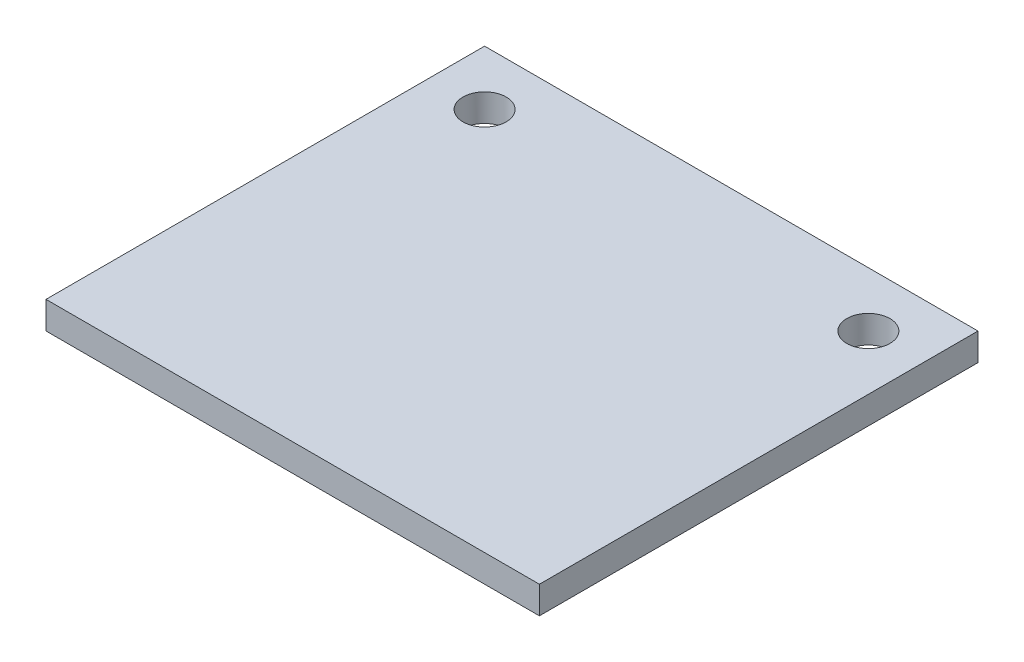
ISO-10303-21;
HEADER;
FILE_DESCRIPTION(('STEP AP214'),'2;1');
FILE_NAME('part.step','',(''),(''),'','','');
FILE_SCHEMA(('AUTOMOTIVE_DESIGN { 1 0 10303 214 1 1 1 1 }'));
ENDSEC;
DATA;
#1=APPLICATION_CONTEXT('core data for automotive mechanical design processes');
#2=APPLICATION_PROTOCOL_DEFINITION('international standard','automotive_design',2000,#1);
#3=PRODUCT_CONTEXT('',#1,'mechanical');
#4=PRODUCT('Part','Part','',(#3));
#5=PRODUCT_RELATED_PRODUCT_CATEGORY('part','',(#4));
#6=PRODUCT_DEFINITION_FORMATION('','',#4);
#7=PRODUCT_DEFINITION_CONTEXT('part definition',#1,'design');
#8=PRODUCT_DEFINITION('design','',#6,#7);
#9=PRODUCT_DEFINITION_SHAPE('','',#8);
#10=(LENGTH_UNIT() NAMED_UNIT(*) SI_UNIT(.MILLI.,.METRE.));
#11=(NAMED_UNIT(*) PLANE_ANGLE_UNIT() SI_UNIT($,.RADIAN.));
#12=(NAMED_UNIT(*) SI_UNIT($,.STERADIAN.) SOLID_ANGLE_UNIT());
#13=UNCERTAINTY_MEASURE_WITH_UNIT(LENGTH_MEASURE(1.E-05),#10,'distance_accuracy_value','');
#14=(GEOMETRIC_REPRESENTATION_CONTEXT(3) GLOBAL_UNCERTAINTY_ASSIGNED_CONTEXT((#13)) GLOBAL_UNIT_ASSIGNED_CONTEXT((#10,
#11,#12)) REPRESENTATION_CONTEXT('',''));
#15=CARTESIAN_POINT('',(0.,0.,0.));
#16=DIRECTION('',(0.,0.,1.));
#17=DIRECTION('',(1.,0.,0.));
#18=AXIS2_PLACEMENT_3D('',#15,#16,#17);
#19=CARTESIAN_POINT('',(11.43,0.635,10.16));
#20=DIRECTION('',(-1.,0.,0.));
#21=DIRECTION('',(0.,0.,1.));
#22=AXIS2_PLACEMENT_3D('',#19,#20,#21);
#23=PLANE('',#22);
#24=DIRECTION('',(0.,0.,-1.));
#25=VECTOR('',#24,1.);
#26=CARTESIAN_POINT('',(11.43,-0.635,10.16));
#27=LINE('',#26,#25);
#28=CARTESIAN_POINT('',(11.43,-0.635,10.16));
#29=VERTEX_POINT('',#28);
#30=CARTESIAN_POINT('',(11.43,-0.635,-10.16));
#31=VERTEX_POINT('',#30);
#32=EDGE_CURVE('E113',#29,#31,#27,.T.);
#33=ORIENTED_EDGE('',*,*,#32,.T.);
#34=DIRECTION('',(0.,-1.,0.));
#35=VECTOR('',#34,1.);
#36=CARTESIAN_POINT('',(11.43,0.635,-10.16));
#37=LINE('',#36,#35);
#38=CARTESIAN_POINT('',(11.43,0.635,-10.16));
#39=VERTEX_POINT('',#38);
#40=EDGE_CURVE('E11',#39,#31,#37,.T.);
#41=ORIENTED_EDGE('',*,*,#40,.F.);
#42=DIRECTION('',(0.,0.,-1.));
#43=VECTOR('',#42,1.);
#44=CARTESIAN_POINT('',(11.43,0.635,10.16));
#45=LINE('',#44,#43);
#46=CARTESIAN_POINT('',(11.43,0.635,10.16));
#47=VERTEX_POINT('',#46);
#48=EDGE_CURVE('E97',#47,#39,#45,.T.);
#49=ORIENTED_EDGE('',*,*,#48,.F.);
#50=DIRECTION('',(0.,-1.,0.));
#51=VECTOR('',#50,1.);
#52=CARTESIAN_POINT('',(11.43,0.635,10.16));
#53=LINE('',#52,#51);
#54=EDGE_CURVE('E109',#47,#29,#53,.T.);
#55=ORIENTED_EDGE('',*,*,#54,.T.);
#56=EDGE_LOOP('',(#33,#41,#49,#55));
#57=FACE_BOUND('',#56,.T.);
#58=ADVANCED_FACE('F45',(#57),#23,.F.);
#59=CARTESIAN_POINT('',(-11.43,0.635,-10.16));
#60=DIRECTION('',(0.,0.,1.));
#61=DIRECTION('',(1.,0.,0.));
#62=AXIS2_PLACEMENT_3D('',#59,#60,#61);
#63=PLANE('',#62);
#64=DIRECTION('',(-1.,0.,0.));
#65=VECTOR('',#64,1.);
#66=CARTESIAN_POINT('',(-11.43,-0.635,-10.16));
#67=LINE('',#66,#65);
#68=CARTESIAN_POINT('',(-11.43,-0.635,-10.16));
#69=VERTEX_POINT('',#68);
#70=EDGE_CURVE('E102',#31,#69,#67,.T.);
#71=ORIENTED_EDGE('',*,*,#70,.T.);
#72=DIRECTION('',(0.,-1.,0.));
#73=VECTOR('',#72,1.);
#74=CARTESIAN_POINT('',(-11.43,0.635,-10.16));
#75=LINE('',#74,#73);
#76=CARTESIAN_POINT('',(-11.43,0.635,-10.16));
#77=VERTEX_POINT('',#76);
#78=EDGE_CURVE('E54',#77,#69,#75,.T.);
#79=ORIENTED_EDGE('',*,*,#78,.F.);
#80=DIRECTION('',(-1.,0.,0.));
#81=VECTOR('',#80,1.);
#82=CARTESIAN_POINT('',(-11.43,0.635,-10.16));
#83=LINE('',#82,#81);
#84=EDGE_CURVE('E92',#39,#77,#83,.T.);
#85=ORIENTED_EDGE('',*,*,#84,.F.);
#86=ORIENTED_EDGE('',*,*,#40,.T.);
#87=EDGE_LOOP('',(#71,#79,#85,#86));
#88=FACE_BOUND('',#87,.T.);
#89=ADVANCED_FACE('F101',(#88),#63,.F.);
#90=CARTESIAN_POINT('',(-11.43,0.635,10.16));
#91=DIRECTION('',(1.,0.,0.));
#92=DIRECTION('',(0.,0.,-1.));
#93=AXIS2_PLACEMENT_3D('',#90,#91,#92);
#94=PLANE('',#93);
#95=DIRECTION('',(0.,0.,1.));
#96=VECTOR('',#95,1.);
#97=CARTESIAN_POINT('',(-11.43,-0.635,10.16));
#98=LINE('',#97,#96);
#99=CARTESIAN_POINT('',(-11.43,-0.635,10.16));
#100=VERTEX_POINT('',#99);
#101=EDGE_CURVE('E79',#69,#100,#98,.T.);
#102=ORIENTED_EDGE('',*,*,#101,.T.);
#103=DIRECTION('',(0.,-1.,0.));
#104=VECTOR('',#103,1.);
#105=CARTESIAN_POINT('',(-11.43,0.635,10.16));
#106=LINE('',#105,#104);
#107=CARTESIAN_POINT('',(-11.43,0.635,10.16));
#108=VERTEX_POINT('',#107);
#109=EDGE_CURVE('E104',#108,#100,#106,.T.);
#110=ORIENTED_EDGE('',*,*,#109,.F.);
#111=DIRECTION('',(0.,0.,1.));
#112=VECTOR('',#111,1.);
#113=CARTESIAN_POINT('',(-11.43,0.635,10.16));
#114=LINE('',#113,#112);
#115=EDGE_CURVE('E95',#77,#108,#114,.T.);
#116=ORIENTED_EDGE('',*,*,#115,.F.);
#117=ORIENTED_EDGE('',*,*,#78,.T.);
#118=EDGE_LOOP('',(#102,#110,#116,#117));
#119=FACE_BOUND('',#118,.T.);
#120=ADVANCED_FACE('F105',(#119),#94,.F.);
#121=CARTESIAN_POINT('',(-11.43,0.635,10.16));
#122=DIRECTION('',(0.,0.,-1.));
#123=DIRECTION('',(-1.,0.,0.));
#124=AXIS2_PLACEMENT_3D('',#121,#122,#123);
#125=PLANE('',#124);
#126=DIRECTION('',(1.,0.,0.));
#127=VECTOR('',#126,1.);
#128=CARTESIAN_POINT('',(-11.43,-0.635,10.16));
#129=LINE('',#128,#127);
#130=EDGE_CURVE('E85',#100,#29,#129,.T.);
#131=ORIENTED_EDGE('',*,*,#130,.T.);
#132=ORIENTED_EDGE('',*,*,#54,.F.);
#133=DIRECTION('',(1.,0.,0.));
#134=VECTOR('',#133,1.);
#135=CARTESIAN_POINT('',(-11.43,0.635,10.16));
#136=LINE('',#135,#134);
#137=EDGE_CURVE('E62',#108,#47,#136,.T.);
#138=ORIENTED_EDGE('',*,*,#137,.F.);
#139=ORIENTED_EDGE('',*,*,#109,.T.);
#140=EDGE_LOOP('',(#131,#132,#138,#139));
#141=FACE_BOUND('',#140,.T.);
#142=ADVANCED_FACE('F127',(#141),#125,.F.);
#143=CARTESIAN_POINT('',(0.,0.635,0.));
#144=DIRECTION('',(0.,-1.,0.));
#145=DIRECTION('',(0.,0.,-1.));
#146=AXIS2_PLACEMENT_3D('',#143,#144,#145);
#147=PLANE('',#146);
#148=CARTESIAN_POINT('',(-8.89,0.635,-7.62));
#149=DIRECTION('',(0.,-1.,0.));
#150=DIRECTION('',(0.,0.,-1.));
#151=AXIS2_PLACEMENT_3D('',#148,#149,#150);
#152=CIRCLE('',#151,0.999999999999999);
#153=CARTESIAN_POINT('',(-8.89,0.635,-8.62));
#154=VERTEX_POINT('',#153);
#155=EDGE_CURVE('E117',#154,#154,#152,.T.);
#156=ORIENTED_EDGE('',*,*,#155,.T.);
#157=EDGE_LOOP('',(#156));
#158=FACE_BOUND('',#157,.T.);
#159=CARTESIAN_POINT('',(8.89,0.635,-7.62));
#160=DIRECTION('',(0.,-1.,0.));
#161=DIRECTION('',(0.,0.,-1.));
#162=AXIS2_PLACEMENT_3D('',#159,#160,#161);
#163=CIRCLE('',#162,0.999999999999999);
#164=CARTESIAN_POINT('',(8.89,0.635,-8.62));
#165=VERTEX_POINT('',#164);
#166=EDGE_CURVE('E137',#165,#165,#163,.T.);
#167=ORIENTED_EDGE('',*,*,#166,.T.);
#168=EDGE_LOOP('',(#167));
#169=FACE_BOUND('',#168,.T.);
#170=ORIENTED_EDGE('',*,*,#48,.T.);
#171=ORIENTED_EDGE('',*,*,#84,.T.);
#172=ORIENTED_EDGE('',*,*,#115,.T.);
#173=ORIENTED_EDGE('',*,*,#137,.T.);
#174=EDGE_LOOP('',(#170,#171,#172,#173));
#175=FACE_BOUND('',#174,.T.);
#176=ADVANCED_FACE('F93',(#158,#169,#175),#147,.F.);
#177=CARTESIAN_POINT('',(0.,-0.635,0.));
#178=DIRECTION('',(0.,-1.,0.));
#179=DIRECTION('',(0.,0.,-1.));
#180=AXIS2_PLACEMENT_3D('',#177,#178,#179);
#181=PLANE('',#180);
#182=CARTESIAN_POINT('',(-8.89,-0.635,-7.62));
#183=DIRECTION('',(0.,1.,0.));
#184=DIRECTION('',(0.,0.,1.));
#185=AXIS2_PLACEMENT_3D('',#182,#183,#184);
#186=CIRCLE('',#185,0.999999999999999);
#187=CARTESIAN_POINT('',(-8.89,-0.635,-6.62));
#188=VERTEX_POINT('',#187);
#189=EDGE_CURVE('E141',#188,#188,#186,.T.);
#190=ORIENTED_EDGE('',*,*,#189,.T.);
#191=EDGE_LOOP('',(#190));
#192=FACE_BOUND('',#191,.T.);
#193=CARTESIAN_POINT('',(8.89,-0.635,-7.62));
#194=DIRECTION('',(0.,1.,0.));
#195=DIRECTION('',(0.,0.,-1.));
#196=AXIS2_PLACEMENT_3D('',#193,#194,#195);
#197=CIRCLE('',#196,0.999999999999999);
#198=CARTESIAN_POINT('',(8.89,-0.635,-8.62));
#199=VERTEX_POINT('',#198);
#200=EDGE_CURVE('E142',#199,#199,#197,.T.);
#201=ORIENTED_EDGE('',*,*,#200,.T.);
#202=EDGE_LOOP('',(#201));
#203=FACE_BOUND('',#202,.T.);
#204=ORIENTED_EDGE('',*,*,#32,.F.);
#205=ORIENTED_EDGE('',*,*,#130,.F.);
#206=ORIENTED_EDGE('',*,*,#101,.F.);
#207=ORIENTED_EDGE('',*,*,#70,.F.);
#208=EDGE_LOOP('',(#204,#205,#206,#207));
#209=FACE_BOUND('',#208,.T.);
#210=ADVANCED_FACE('F130',(#192,#203,#209),#181,.T.);
#211=CARTESIAN_POINT('',(8.89,-0.635,-7.62));
#212=DIRECTION('',(0.,1.,0.));
#213=DIRECTION('',(0.,0.,1.));
#214=AXIS2_PLACEMENT_3D('',#211,#212,#213);
#215=CYLINDRICAL_SURFACE('',#214,0.999999999999999);
#216=ORIENTED_EDGE('',*,*,#200,.F.);
#217=EDGE_LOOP('',(#216));
#218=FACE_BOUND('',#217,.T.);
#219=ORIENTED_EDGE('',*,*,#166,.F.);
#220=EDGE_LOOP('',(#219));
#221=FACE_BOUND('',#220,.T.);
#222=ADVANCED_FACE('F155',(#218,#221),#215,.F.);
#223=CARTESIAN_POINT('',(-8.89,-0.635,-7.62));
#224=DIRECTION('',(0.,1.,0.));
#225=DIRECTION('',(0.,0.,1.));
#226=AXIS2_PLACEMENT_3D('',#223,#224,#225);
#227=CYLINDRICAL_SURFACE('',#226,0.999999999999999);
#228=ORIENTED_EDGE('',*,*,#189,.F.);
#229=EDGE_LOOP('',(#228));
#230=FACE_BOUND('',#229,.T.);
#231=ORIENTED_EDGE('',*,*,#155,.F.);
#232=EDGE_LOOP('',(#231));
#233=FACE_BOUND('',#232,.T.);
#234=ADVANCED_FACE('F152',(#230,#233),#227,.F.);
#235=CLOSED_SHELL('',(#58,#89,#120,#142,#176,#210,#222,#234));
#236=MANIFOLD_SOLID_BREP('B2',#235);
#237=ADVANCED_BREP_SHAPE_REPRESENTATION('',(#18,#236),#14);
#238=SHAPE_DEFINITION_REPRESENTATION(#9,#237);
ENDSEC;
END-ISO-10303-21;
